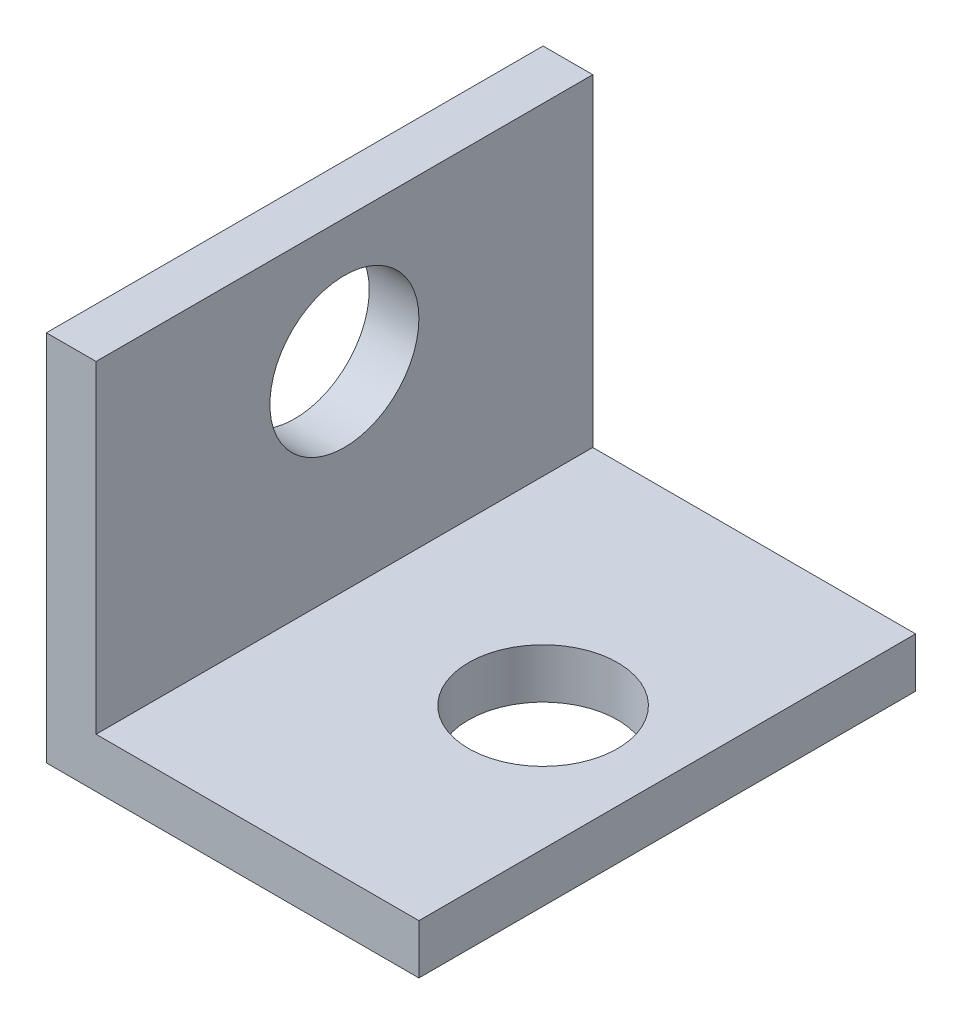
ISO-10303-21;
HEADER;
FILE_DESCRIPTION(('STEP AP214'),'2;1');
FILE_NAME('part.step','',(''),(''),'','','');
FILE_SCHEMA(('AUTOMOTIVE_DESIGN { 1 0 10303 214 1 1 1 1 }'));
ENDSEC;
DATA;
#1=APPLICATION_CONTEXT('core data for automotive mechanical design processes');
#2=APPLICATION_PROTOCOL_DEFINITION('international standard','automotive_design',2000,#1);
#3=PRODUCT_CONTEXT('',#1,'mechanical');
#4=PRODUCT('Part','Part','',(#3));
#5=PRODUCT_RELATED_PRODUCT_CATEGORY('part','',(#4));
#6=PRODUCT_DEFINITION_FORMATION('','',#4);
#7=PRODUCT_DEFINITION_CONTEXT('part definition',#1,'design');
#8=PRODUCT_DEFINITION('design','',#6,#7);
#9=PRODUCT_DEFINITION_SHAPE('','',#8);
#10=(LENGTH_UNIT() NAMED_UNIT(*) SI_UNIT(.MILLI.,.METRE.));
#11=(NAMED_UNIT(*) PLANE_ANGLE_UNIT() SI_UNIT($,.RADIAN.));
#12=(NAMED_UNIT(*) SI_UNIT($,.STERADIAN.) SOLID_ANGLE_UNIT());
#13=UNCERTAINTY_MEASURE_WITH_UNIT(LENGTH_MEASURE(1.E-05),#10,'distance_accuracy_value','');
#14=(GEOMETRIC_REPRESENTATION_CONTEXT(3) GLOBAL_UNCERTAINTY_ASSIGNED_CONTEXT((#13)) GLOBAL_UNIT_ASSIGNED_CONTEXT((#10,
#11,#12)) REPRESENTATION_CONTEXT('',''));
#15=CARTESIAN_POINT('',(0.,0.,0.));
#16=DIRECTION('',(0.,0.,1.));
#17=DIRECTION('',(1.,0.,0.));
#18=AXIS2_PLACEMENT_3D('',#15,#16,#17);
#19=CARTESIAN_POINT('',(0.,15.,20.));
#20=DIRECTION('',(1.,0.,0.));
#21=DIRECTION('',(0.,1.,0.));
#22=AXIS2_PLACEMENT_3D('',#19,#20,#21);
#23=PLANE('',#22);
#24=CARTESIAN_POINT('',(0.,10.,10.));
#25=DIRECTION('',(1.,0.,0.));
#26=DIRECTION('',(0.,1.,0.));
#27=AXIS2_PLACEMENT_3D('',#24,#25,#26);
#28=CIRCLE('',#27,3.);
#29=CARTESIAN_POINT('',(0.,13.,10.));
#30=VERTEX_POINT('',#29);
#31=EDGE_CURVE('E182',#30,#30,#28,.T.);
#32=ORIENTED_EDGE('',*,*,#31,.T.);
#33=EDGE_LOOP('',(#32));
#34=FACE_BOUND('',#33,.T.);
#35=DIRECTION('',(0.,-1.,0.));
#36=VECTOR('',#35,1.);
#37=CARTESIAN_POINT('',(0.,15.,0.));
#38=LINE('',#37,#36);
#39=CARTESIAN_POINT('',(0.,15.,0.));
#40=VERTEX_POINT('',#39);
#41=CARTESIAN_POINT('',(0.,0.,0.));
#42=VERTEX_POINT('',#41);
#43=EDGE_CURVE('E128',#40,#42,#38,.T.);
#44=ORIENTED_EDGE('',*,*,#43,.T.);
#45=DIRECTION('',(0.,0.,-1.));
#46=VECTOR('',#45,1.);
#47=CARTESIAN_POINT('',(0.,0.,20.));
#48=LINE('',#47,#46);
#49=CARTESIAN_POINT('',(0.,0.,20.));
#50=VERTEX_POINT('',#49);
#51=EDGE_CURVE('E11',#50,#42,#48,.T.);
#52=ORIENTED_EDGE('',*,*,#51,.F.);
#53=DIRECTION('',(0.,-1.,0.));
#54=VECTOR('',#53,1.);
#55=CARTESIAN_POINT('',(0.,15.,20.));
#56=LINE('',#55,#54);
#57=CARTESIAN_POINT('',(0.,15.,20.));
#58=VERTEX_POINT('',#57);
#59=EDGE_CURVE('E145',#58,#50,#56,.T.);
#60=ORIENTED_EDGE('',*,*,#59,.F.);
#61=DIRECTION('',(0.,0.,-1.));
#62=VECTOR('',#61,1.);
#63=CARTESIAN_POINT('',(0.,15.,20.));
#64=LINE('',#63,#62);
#65=EDGE_CURVE('E124',#58,#40,#64,.T.);
#66=ORIENTED_EDGE('',*,*,#65,.T.);
#67=EDGE_LOOP('',(#44,#52,#60,#66));
#68=FACE_BOUND('',#67,.T.);
#69=ADVANCED_FACE('F39',(#34,#68),#23,.F.);
#70=CARTESIAN_POINT('',(0.,0.,20.));
#71=DIRECTION('',(0.,1.,0.));
#72=DIRECTION('',(0.,0.,1.));
#73=AXIS2_PLACEMENT_3D('',#70,#71,#72);
#74=PLANE('',#73);
#75=CARTESIAN_POINT('',(10.,0.,10.));
#76=DIRECTION('',(0.,1.,0.));
#77=DIRECTION('',(0.,0.,1.));
#78=AXIS2_PLACEMENT_3D('',#75,#76,#77);
#79=CIRCLE('',#78,3.);
#80=CARTESIAN_POINT('',(10.,0.,13.));
#81=VERTEX_POINT('',#80);
#82=EDGE_CURVE('E133',#81,#81,#79,.F.);
#83=ORIENTED_EDGE('',*,*,#82,.F.);
#84=EDGE_LOOP('',(#83));
#85=FACE_BOUND('',#84,.T.);
#86=DIRECTION('',(1.,0.,0.));
#87=VECTOR('',#86,1.);
#88=CARTESIAN_POINT('',(0.,0.,0.));
#89=LINE('',#88,#87);
#90=CARTESIAN_POINT('',(15.,0.,0.));
#91=VERTEX_POINT('',#90);
#92=EDGE_CURVE('E132',#42,#91,#89,.T.);
#93=ORIENTED_EDGE('',*,*,#92,.T.);
#94=DIRECTION('',(0.,0.,-1.));
#95=VECTOR('',#94,1.);
#96=CARTESIAN_POINT('',(15.,0.,20.));
#97=LINE('',#96,#95);
#98=CARTESIAN_POINT('',(15.,0.,20.));
#99=VERTEX_POINT('',#98);
#100=EDGE_CURVE('E48',#99,#91,#97,.T.);
#101=ORIENTED_EDGE('',*,*,#100,.F.);
#102=DIRECTION('',(1.,0.,0.));
#103=VECTOR('',#102,1.);
#104=CARTESIAN_POINT('',(0.,0.,20.));
#105=LINE('',#104,#103);
#106=EDGE_CURVE('E93',#50,#99,#105,.T.);
#107=ORIENTED_EDGE('',*,*,#106,.F.);
#108=ORIENTED_EDGE('',*,*,#51,.T.);
#109=EDGE_LOOP('',(#93,#101,#107,#108));
#110=FACE_BOUND('',#109,.T.);
#111=ADVANCED_FACE('F174',(#85,#110),#74,.F.);
#112=CARTESIAN_POINT('',(15.,0.,20.));
#113=DIRECTION('',(-1.,0.,0.));
#114=DIRECTION('',(0.,0.,1.));
#115=AXIS2_PLACEMENT_3D('',#112,#113,#114);
#116=PLANE('',#115);
#117=DIRECTION('',(0.,1.,0.));
#118=VECTOR('',#117,1.);
#119=CARTESIAN_POINT('',(15.,0.,0.));
#120=LINE('',#119,#118);
#121=CARTESIAN_POINT('',(15.,2.,0.));
#122=VERTEX_POINT('',#121);
#123=EDGE_CURVE('E136',#91,#122,#120,.T.);
#124=ORIENTED_EDGE('',*,*,#123,.T.);
#125=DIRECTION('',(0.,0.,-1.));
#126=VECTOR('',#125,1.);
#127=CARTESIAN_POINT('',(15.,2.,20.));
#128=LINE('',#127,#126);
#129=CARTESIAN_POINT('',(15.,2.,20.));
#130=VERTEX_POINT('',#129);
#131=EDGE_CURVE('E117',#130,#122,#128,.T.);
#132=ORIENTED_EDGE('',*,*,#131,.F.);
#133=DIRECTION('',(0.,1.,0.));
#134=VECTOR('',#133,1.);
#135=CARTESIAN_POINT('',(15.,0.,20.));
#136=LINE('',#135,#134);
#137=EDGE_CURVE('E106',#99,#130,#136,.T.);
#138=ORIENTED_EDGE('',*,*,#137,.F.);
#139=ORIENTED_EDGE('',*,*,#100,.T.);
#140=EDGE_LOOP('',(#124,#132,#138,#139));
#141=FACE_BOUND('',#140,.T.);
#142=ADVANCED_FACE('F155',(#141),#116,.F.);
#143=CARTESIAN_POINT('',(15.,2.,20.));
#144=DIRECTION('',(0.,-1.,0.));
#145=DIRECTION('',(1.,0.,0.));
#146=AXIS2_PLACEMENT_3D('',#143,#144,#145);
#147=PLANE('',#146);
#148=CARTESIAN_POINT('',(10.,2.,10.));
#149=DIRECTION('',(0.,1.,0.));
#150=DIRECTION('',(-1.,0.,0.));
#151=AXIS2_PLACEMENT_3D('',#148,#149,#150);
#152=CIRCLE('',#151,3.);
#153=CARTESIAN_POINT('',(7.,2.,10.));
#154=VERTEX_POINT('',#153);
#155=EDGE_CURVE('E185',#154,#154,#152,.T.);
#156=ORIENTED_EDGE('',*,*,#155,.F.);
#157=EDGE_LOOP('',(#156));
#158=FACE_BOUND('',#157,.T.);
#159=DIRECTION('',(-1.,0.,0.));
#160=VECTOR('',#159,1.);
#161=CARTESIAN_POINT('',(15.,2.,0.));
#162=LINE('',#161,#160);
#163=CARTESIAN_POINT('',(2.,2.,0.));
#164=VERTEX_POINT('',#163);
#165=EDGE_CURVE('E115',#122,#164,#162,.T.);
#166=ORIENTED_EDGE('',*,*,#165,.T.);
#167=DIRECTION('',(0.,0.,-1.));
#168=VECTOR('',#167,1.);
#169=CARTESIAN_POINT('',(2.,2.,20.));
#170=LINE('',#169,#168);
#171=CARTESIAN_POINT('',(2.,2.,20.));
#172=VERTEX_POINT('',#171);
#173=EDGE_CURVE('E112',#172,#164,#170,.T.);
#174=ORIENTED_EDGE('',*,*,#173,.F.);
#175=DIRECTION('',(-1.,0.,0.));
#176=VECTOR('',#175,1.);
#177=CARTESIAN_POINT('',(15.,2.,20.));
#178=LINE('',#177,#176);
#179=EDGE_CURVE('E100',#130,#172,#178,.T.);
#180=ORIENTED_EDGE('',*,*,#179,.F.);
#181=ORIENTED_EDGE('',*,*,#131,.T.);
#182=EDGE_LOOP('',(#166,#174,#180,#181));
#183=FACE_BOUND('',#182,.T.);
#184=ADVANCED_FACE('F113',(#158,#183),#147,.F.);
#185=CARTESIAN_POINT('',(2.,2.,20.));
#186=DIRECTION('',(-1.,0.,0.));
#187=DIRECTION('',(0.,0.,1.));
#188=AXIS2_PLACEMENT_3D('',#185,#186,#187);
#189=PLANE('',#188);
#190=CARTESIAN_POINT('',(2.,10.,10.));
#191=DIRECTION('',(1.,0.,0.));
#192=DIRECTION('',(0.,0.,-1.));
#193=AXIS2_PLACEMENT_3D('',#190,#191,#192);
#194=CIRCLE('',#193,3.);
#195=CARTESIAN_POINT('',(2.,10.,7.));
#196=VERTEX_POINT('',#195);
#197=EDGE_CURVE('E186',#196,#196,#194,.T.);
#198=ORIENTED_EDGE('',*,*,#197,.F.);
#199=EDGE_LOOP('',(#198));
#200=FACE_BOUND('',#199,.T.);
#201=DIRECTION('',(0.,1.,0.));
#202=VECTOR('',#201,1.);
#203=CARTESIAN_POINT('',(2.,2.,0.));
#204=LINE('',#203,#202);
#205=CARTESIAN_POINT('',(2.,15.,0.));
#206=VERTEX_POINT('',#205);
#207=EDGE_CURVE('E79',#164,#206,#204,.T.);
#208=ORIENTED_EDGE('',*,*,#207,.T.);
#209=DIRECTION('',(0.,0.,-1.));
#210=VECTOR('',#209,1.);
#211=CARTESIAN_POINT('',(2.,15.,20.));
#212=LINE('',#211,#210);
#213=CARTESIAN_POINT('',(2.,15.,20.));
#214=VERTEX_POINT('',#213);
#215=EDGE_CURVE('E118',#214,#206,#212,.T.);
#216=ORIENTED_EDGE('',*,*,#215,.F.);
#217=DIRECTION('',(0.,1.,0.));
#218=VECTOR('',#217,1.);
#219=CARTESIAN_POINT('',(2.,2.,20.));
#220=LINE('',#219,#218);
#221=EDGE_CURVE('E104',#172,#214,#220,.T.);
#222=ORIENTED_EDGE('',*,*,#221,.F.);
#223=ORIENTED_EDGE('',*,*,#173,.T.);
#224=EDGE_LOOP('',(#208,#216,#222,#223));
#225=FACE_BOUND('',#224,.T.);
#226=ADVANCED_FACE('F120',(#200,#225),#189,.F.);
#227=CARTESIAN_POINT('',(2.,15.,20.));
#228=DIRECTION('',(0.,-1.,0.));
#229=DIRECTION('',(0.,0.,-1.));
#230=AXIS2_PLACEMENT_3D('',#227,#228,#229);
#231=PLANE('',#230);
#232=DIRECTION('',(-1.,0.,0.));
#233=VECTOR('',#232,1.);
#234=CARTESIAN_POINT('',(2.,15.,0.));
#235=LINE('',#234,#233);
#236=EDGE_CURVE('E85',#206,#40,#235,.T.);
#237=ORIENTED_EDGE('',*,*,#236,.T.);
#238=ORIENTED_EDGE('',*,*,#65,.F.);
#239=DIRECTION('',(-1.,0.,0.));
#240=VECTOR('',#239,1.);
#241=CARTESIAN_POINT('',(2.,15.,20.));
#242=LINE('',#241,#240);
#243=EDGE_CURVE('E56',#214,#58,#242,.T.);
#244=ORIENTED_EDGE('',*,*,#243,.F.);
#245=ORIENTED_EDGE('',*,*,#215,.T.);
#246=EDGE_LOOP('',(#237,#238,#244,#245));
#247=FACE_BOUND('',#246,.T.);
#248=ADVANCED_FACE('F162',(#247),#231,.F.);
#249=CARTESIAN_POINT('',(0.,0.,20.));
#250=DIRECTION('',(0.,0.,1.));
#251=DIRECTION('',(1.,0.,0.));
#252=AXIS2_PLACEMENT_3D('',#249,#250,#251);
#253=PLANE('',#252);
#254=ORIENTED_EDGE('',*,*,#59,.T.);
#255=ORIENTED_EDGE('',*,*,#106,.T.);
#256=ORIENTED_EDGE('',*,*,#137,.T.);
#257=ORIENTED_EDGE('',*,*,#179,.T.);
#258=ORIENTED_EDGE('',*,*,#221,.T.);
#259=ORIENTED_EDGE('',*,*,#243,.T.);
#260=EDGE_LOOP('',(#254,#255,#256,#257,#258,#259));
#261=FACE_BOUND('',#260,.T.);
#262=ADVANCED_FACE('F102',(#261),#253,.T.);
#263=CARTESIAN_POINT('',(0.,0.,0.));
#264=DIRECTION('',(0.,0.,1.));
#265=DIRECTION('',(1.,0.,0.));
#266=AXIS2_PLACEMENT_3D('',#263,#264,#265);
#267=PLANE('',#266);
#268=ORIENTED_EDGE('',*,*,#43,.F.);
#269=ORIENTED_EDGE('',*,*,#236,.F.);
#270=ORIENTED_EDGE('',*,*,#207,.F.);
#271=ORIENTED_EDGE('',*,*,#165,.F.);
#272=ORIENTED_EDGE('',*,*,#123,.F.);
#273=ORIENTED_EDGE('',*,*,#92,.F.);
#274=EDGE_LOOP('',(#268,#269,#270,#271,#272,#273));
#275=FACE_BOUND('',#274,.T.);
#276=ADVANCED_FACE('F158',(#275),#267,.F.);
#277=CARTESIAN_POINT('',(10.,-0.00100000000000057,10.));
#278=DIRECTION('',(0.,1.,0.));
#279=DIRECTION('',(-1.,0.,0.));
#280=AXIS2_PLACEMENT_3D('',#277,#278,#279);
#281=CYLINDRICAL_SURFACE('',#280,3.);
#282=ORIENTED_EDGE('',*,*,#155,.T.);
#283=EDGE_LOOP('',(#282));
#284=FACE_BOUND('',#283,.T.);
#285=ORIENTED_EDGE('',*,*,#82,.T.);
#286=EDGE_LOOP('',(#285));
#287=FACE_BOUND('',#286,.T.);
#288=ADVANCED_FACE('F204',(#284,#287),#281,.F.);
#289=CARTESIAN_POINT('',(-18.,10.,10.));
#290=DIRECTION('',(1.,0.,0.));
#291=DIRECTION('',(0.,0.,-1.));
#292=AXIS2_PLACEMENT_3D('',#289,#290,#291);
#293=CYLINDRICAL_SURFACE('',#292,3.);
#294=ORIENTED_EDGE('',*,*,#197,.T.);
#295=EDGE_LOOP('',(#294));
#296=FACE_BOUND('',#295,.T.);
#297=ORIENTED_EDGE('',*,*,#31,.F.);
#298=EDGE_LOOP('',(#297));
#299=FACE_BOUND('',#298,.T.);
#300=ADVANCED_FACE('F206',(#296,#299),#293,.F.);
#301=CLOSED_SHELL('',(#69,#111,#142,#184,#226,#248,#262,#276,#288,#300));
#302=MANIFOLD_SOLID_BREP('B2',#301);
#303=ADVANCED_BREP_SHAPE_REPRESENTATION('',(#18,#302),#14);
#304=SHAPE_DEFINITION_REPRESENTATION(#9,#303);
ENDSEC;
END-ISO-10303-21;
